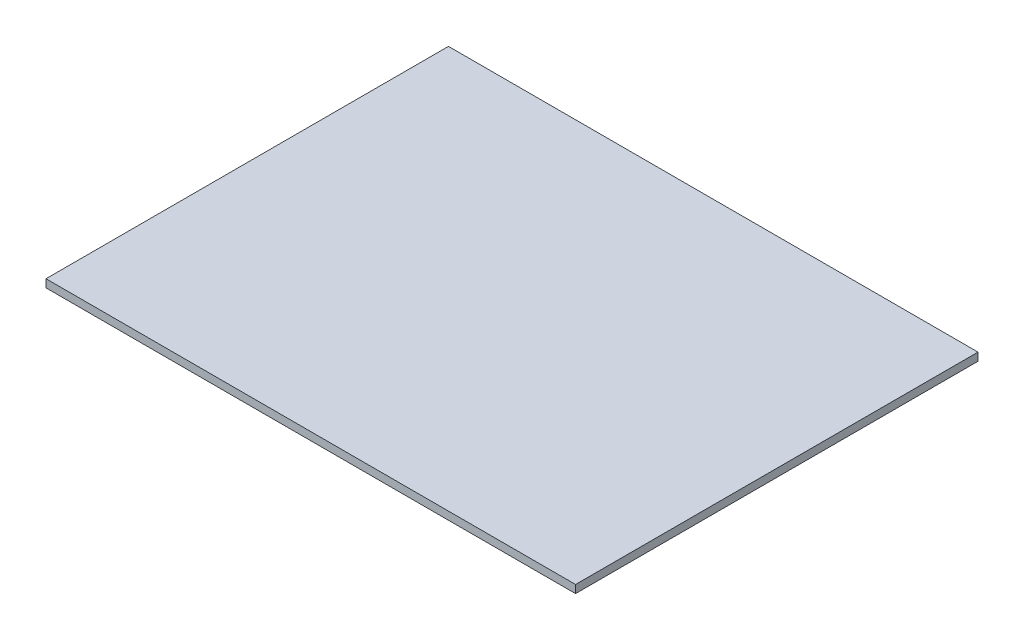
ISO-10303-21;
HEADER;
FILE_DESCRIPTION(('STEP AP214'),'2;1');
FILE_NAME('part.step','',(''),(''),'','','');
FILE_SCHEMA(('AUTOMOTIVE_DESIGN { 1 0 10303 214 1 1 1 1 }'));
ENDSEC;
DATA;
#1=APPLICATION_CONTEXT('core data for automotive mechanical design processes');
#2=APPLICATION_PROTOCOL_DEFINITION('international standard','automotive_design',2000,#1);
#3=PRODUCT_CONTEXT('',#1,'mechanical');
#4=PRODUCT('Part','Part','',(#3));
#5=PRODUCT_RELATED_PRODUCT_CATEGORY('part','',(#4));
#6=PRODUCT_DEFINITION_FORMATION('','',#4);
#7=PRODUCT_DEFINITION_CONTEXT('part definition',#1,'design');
#8=PRODUCT_DEFINITION('design','',#6,#7);
#9=PRODUCT_DEFINITION_SHAPE('','',#8);
#10=(LENGTH_UNIT() NAMED_UNIT(*) SI_UNIT(.MILLI.,.METRE.));
#11=(NAMED_UNIT(*) PLANE_ANGLE_UNIT() SI_UNIT($,.RADIAN.));
#12=(NAMED_UNIT(*) SI_UNIT($,.STERADIAN.) SOLID_ANGLE_UNIT());
#13=UNCERTAINTY_MEASURE_WITH_UNIT(LENGTH_MEASURE(1.E-05),#10,'distance_accuracy_value','');
#14=(GEOMETRIC_REPRESENTATION_CONTEXT(3) GLOBAL_UNCERTAINTY_ASSIGNED_CONTEXT((#13)) GLOBAL_UNIT_ASSIGNED_CONTEXT((#10,
#11,#12)) REPRESENTATION_CONTEXT('',''));
#15=CARTESIAN_POINT('',(0.,0.,0.));
#16=DIRECTION('',(0.,0.,1.));
#17=DIRECTION('',(1.,0.,0.));
#18=AXIS2_PLACEMENT_3D('',#15,#16,#17);
#19=CARTESIAN_POINT('',(0.,1.5,-76.));
#20=DIRECTION('',(0.,0.,1.));
#21=DIRECTION('',(1.,0.,0.));
#22=AXIS2_PLACEMENT_3D('',#19,#20,#21);
#23=PLANE('',#22);
#24=DIRECTION('',(-1.,0.,0.));
#25=VECTOR('',#24,1.);
#26=CARTESIAN_POINT('',(0.,0.,-76.));
#27=LINE('',#26,#25);
#28=CARTESIAN_POINT('',(0.,0.,-76.));
#29=VERTEX_POINT('',#28);
#30=CARTESIAN_POINT('',(-100.,0.,-76.));
#31=VERTEX_POINT('',#30);
#32=EDGE_CURVE('E96',#29,#31,#27,.T.);
#33=ORIENTED_EDGE('',*,*,#32,.T.);
#34=DIRECTION('',(0.,-1.,0.));
#35=VECTOR('',#34,1.);
#36=CARTESIAN_POINT('',(-100.,1.5,-76.));
#37=LINE('',#36,#35);
#38=CARTESIAN_POINT('',(-100.,1.5,-76.));
#39=VERTEX_POINT('',#38);
#40=EDGE_CURVE('E11',#39,#31,#37,.T.);
#41=ORIENTED_EDGE('',*,*,#40,.F.);
#42=DIRECTION('',(-1.,0.,0.));
#43=VECTOR('',#42,1.);
#44=CARTESIAN_POINT('',(0.,1.5,-76.));
#45=LINE('',#44,#43);
#46=CARTESIAN_POINT('',(0.,1.5,-76.));
#47=VERTEX_POINT('',#46);
#48=EDGE_CURVE('E84',#47,#39,#45,.T.);
#49=ORIENTED_EDGE('',*,*,#48,.F.);
#50=DIRECTION('',(0.,-1.,0.));
#51=VECTOR('',#50,1.);
#52=CARTESIAN_POINT('',(0.,1.5,-76.));
#53=LINE('',#52,#51);
#54=EDGE_CURVE('E92',#47,#29,#53,.T.);
#55=ORIENTED_EDGE('',*,*,#54,.T.);
#56=EDGE_LOOP('',(#33,#41,#49,#55));
#57=FACE_BOUND('',#56,.T.);
#58=ADVANCED_FACE('F33',(#57),#23,.F.);
#59=CARTESIAN_POINT('',(-100.,1.5,-76.));
#60=DIRECTION('',(1.,0.,0.));
#61=DIRECTION('',(0.,0.,-1.));
#62=AXIS2_PLACEMENT_3D('',#59,#60,#61);
#63=PLANE('',#62);
#64=DIRECTION('',(0.,0.,1.));
#65=VECTOR('',#64,1.);
#66=CARTESIAN_POINT('',(-100.,0.,-76.));
#67=LINE('',#66,#65);
#68=CARTESIAN_POINT('',(-100.,0.,0.));
#69=VERTEX_POINT('',#68);
#70=EDGE_CURVE('E88',#31,#69,#67,.T.);
#71=ORIENTED_EDGE('',*,*,#70,.T.);
#72=DIRECTION('',(0.,-1.,0.));
#73=VECTOR('',#72,1.);
#74=CARTESIAN_POINT('',(-100.,1.5,0.));
#75=LINE('',#74,#73);
#76=CARTESIAN_POINT('',(-100.,1.5,0.));
#77=VERTEX_POINT('',#76);
#78=EDGE_CURVE('E41',#77,#69,#75,.T.);
#79=ORIENTED_EDGE('',*,*,#78,.F.);
#80=DIRECTION('',(0.,0.,1.));
#81=VECTOR('',#80,1.);
#82=CARTESIAN_POINT('',(-100.,1.5,-76.));
#83=LINE('',#82,#81);
#84=EDGE_CURVE('E79',#39,#77,#83,.T.);
#85=ORIENTED_EDGE('',*,*,#84,.F.);
#86=ORIENTED_EDGE('',*,*,#40,.T.);
#87=EDGE_LOOP('',(#71,#79,#85,#86));
#88=FACE_BOUND('',#87,.T.);
#89=ADVANCED_FACE('F87',(#88),#63,.F.);
#90=CARTESIAN_POINT('',(-100.,1.5,0.));
#91=DIRECTION('',(0.,0.,-1.));
#92=DIRECTION('',(-1.,0.,0.));
#93=AXIS2_PLACEMENT_3D('',#90,#91,#92);
#94=PLANE('',#93);
#95=DIRECTION('',(1.,0.,0.));
#96=VECTOR('',#95,1.);
#97=CARTESIAN_POINT('',(-100.,0.,0.));
#98=LINE('',#97,#96);
#99=CARTESIAN_POINT('',(0.,0.,0.));
#100=VERTEX_POINT('',#99);
#101=EDGE_CURVE('E66',#69,#100,#98,.T.);
#102=ORIENTED_EDGE('',*,*,#101,.T.);
#103=DIRECTION('',(0.,-1.,0.));
#104=VECTOR('',#103,1.);
#105=CARTESIAN_POINT('',(0.,1.5,0.));
#106=LINE('',#105,#104);
#107=CARTESIAN_POINT('',(0.,1.5,0.));
#108=VERTEX_POINT('',#107);
#109=EDGE_CURVE('E89',#108,#100,#106,.T.);
#110=ORIENTED_EDGE('',*,*,#109,.F.);
#111=DIRECTION('',(1.,0.,0.));
#112=VECTOR('',#111,1.);
#113=CARTESIAN_POINT('',(-100.,1.5,0.));
#114=LINE('',#113,#112);
#115=EDGE_CURVE('E82',#77,#108,#114,.T.);
#116=ORIENTED_EDGE('',*,*,#115,.F.);
#117=ORIENTED_EDGE('',*,*,#78,.T.);
#118=EDGE_LOOP('',(#102,#110,#116,#117));
#119=FACE_BOUND('',#118,.T.);
#120=ADVANCED_FACE('F90',(#119),#94,.F.);
#121=CARTESIAN_POINT('',(0.,1.5,0.));
#122=DIRECTION('',(-1.,0.,0.));
#123=DIRECTION('',(0.,0.,1.));
#124=AXIS2_PLACEMENT_3D('',#121,#122,#123);
#125=PLANE('',#124);
#126=DIRECTION('',(0.,0.,-1.));
#127=VECTOR('',#126,1.);
#128=CARTESIAN_POINT('',(0.,0.,0.));
#129=LINE('',#128,#127);
#130=EDGE_CURVE('E72',#100,#29,#129,.T.);
#131=ORIENTED_EDGE('',*,*,#130,.T.);
#132=ORIENTED_EDGE('',*,*,#54,.F.);
#133=DIRECTION('',(0.,0.,-1.));
#134=VECTOR('',#133,1.);
#135=CARTESIAN_POINT('',(0.,1.5,0.));
#136=LINE('',#135,#134);
#137=EDGE_CURVE('E49',#108,#47,#136,.T.);
#138=ORIENTED_EDGE('',*,*,#137,.F.);
#139=ORIENTED_EDGE('',*,*,#109,.T.);
#140=EDGE_LOOP('',(#131,#132,#138,#139));
#141=FACE_BOUND('',#140,.T.);
#142=ADVANCED_FACE('F103',(#141),#125,.F.);
#143=CARTESIAN_POINT('',(0.,1.5,0.));
#144=DIRECTION('',(0.,1.,0.));
#145=DIRECTION('',(0.,0.,1.));
#146=AXIS2_PLACEMENT_3D('',#143,#144,#145);
#147=PLANE('',#146);
#148=ORIENTED_EDGE('',*,*,#48,.T.);
#149=ORIENTED_EDGE('',*,*,#84,.T.);
#150=ORIENTED_EDGE('',*,*,#115,.T.);
#151=ORIENTED_EDGE('',*,*,#137,.T.);
#152=EDGE_LOOP('',(#148,#149,#150,#151));
#153=FACE_BOUND('',#152,.T.);
#154=ADVANCED_FACE('F80',(#153),#147,.T.);
#155=CARTESIAN_POINT('',(0.,0.,0.));
#156=DIRECTION('',(0.,1.,0.));
#157=DIRECTION('',(0.,0.,1.));
#158=AXIS2_PLACEMENT_3D('',#155,#156,#157);
#159=PLANE('',#158);
#160=ORIENTED_EDGE('',*,*,#32,.F.);
#161=ORIENTED_EDGE('',*,*,#130,.F.);
#162=ORIENTED_EDGE('',*,*,#101,.F.);
#163=ORIENTED_EDGE('',*,*,#70,.F.);
#164=EDGE_LOOP('',(#160,#161,#162,#163));
#165=FACE_BOUND('',#164,.T.);
#166=ADVANCED_FACE('F106',(#165),#159,.F.);
#167=CLOSED_SHELL('',(#58,#89,#120,#142,#154,#166));
#168=MANIFOLD_SOLID_BREP('B2',#167);
#169=ADVANCED_BREP_SHAPE_REPRESENTATION('',(#18,#168),#14);
#170=SHAPE_DEFINITION_REPRESENTATION(#9,#169);
ENDSEC;
END-ISO-10303-21;
